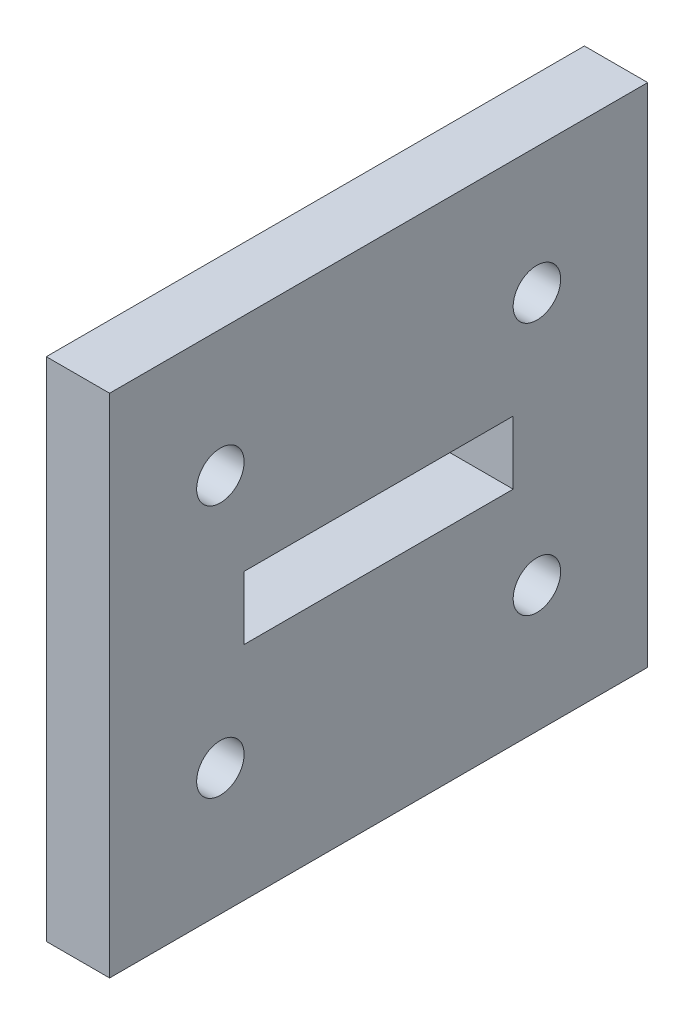
ISO-10303-21;
HEADER;
FILE_DESCRIPTION(('STEP AP214'),'2;1');
FILE_NAME('part.step','',(''),(''),'','','');
FILE_SCHEMA(('AUTOMOTIVE_DESIGN { 1 0 10303 214 1 1 1 1 }'));
ENDSEC;
DATA;
#1=APPLICATION_CONTEXT('core data for automotive mechanical design processes');
#2=APPLICATION_PROTOCOL_DEFINITION('international standard','automotive_design',2000,#1);
#3=PRODUCT_CONTEXT('',#1,'mechanical');
#4=PRODUCT('Part','Part','',(#3));
#5=PRODUCT_RELATED_PRODUCT_CATEGORY('part','',(#4));
#6=PRODUCT_DEFINITION_FORMATION('','',#4);
#7=PRODUCT_DEFINITION_CONTEXT('part definition',#1,'design');
#8=PRODUCT_DEFINITION('design','',#6,#7);
#9=PRODUCT_DEFINITION_SHAPE('','',#8);
#10=(LENGTH_UNIT() NAMED_UNIT(*) SI_UNIT(.MILLI.,.METRE.));
#11=(NAMED_UNIT(*) PLANE_ANGLE_UNIT() SI_UNIT($,.RADIAN.));
#12=(NAMED_UNIT(*) SI_UNIT($,.STERADIAN.) SOLID_ANGLE_UNIT());
#13=UNCERTAINTY_MEASURE_WITH_UNIT(LENGTH_MEASURE(1.E-05),#10,'distance_accuracy_value','');
#14=(GEOMETRIC_REPRESENTATION_CONTEXT(3) GLOBAL_UNCERTAINTY_ASSIGNED_CONTEXT((#13)) GLOBAL_UNIT_ASSIGNED_CONTEXT((#10,
#11,#12)) REPRESENTATION_CONTEXT('',''));
#15=CARTESIAN_POINT('',(0.,0.,0.));
#16=DIRECTION('',(0.,0.,1.));
#17=DIRECTION('',(1.,0.,0.));
#18=AXIS2_PLACEMENT_3D('',#15,#16,#17);
#19=CARTESIAN_POINT('',(29.2,0.,0.));
#20=DIRECTION('',(1.,0.,0.));
#21=DIRECTION('',(0.,1.,0.));
#22=AXIS2_PLACEMENT_3D('',#19,#20,#21);
#23=PLANE('',#22);
#24=DIRECTION('',(0.,-1.,0.));
#25=VECTOR('',#24,1.);
#26=CARTESIAN_POINT('',(29.2,25.4936178572667,4.73630332697817));
#27=LINE('',#26,#25);
#28=CARTESIAN_POINT('',(29.2,25.4936178572667,4.73630332697817));
#29=VERTEX_POINT('',#28);
#30=CARTESIAN_POINT('',(29.2,21.4936178572667,4.73630332697817));
#31=VERTEX_POINT('',#30);
#32=EDGE_CURVE('E50',#29,#31,#27,.T.);
#33=ORIENTED_EDGE('',*,*,#32,.F.);
#34=DIRECTION('',(0.,0.,1.));
#35=VECTOR('',#34,1.);
#36=CARTESIAN_POINT('',(29.2,25.4936178572667,4.73630332697817));
#37=LINE('',#36,#35);
#38=CARTESIAN_POINT('',(29.2,25.4936178572667,-12.2636966730218));
#39=VERTEX_POINT('',#38);
#40=EDGE_CURVE('E118',#39,#29,#37,.T.);
#41=ORIENTED_EDGE('',*,*,#40,.F.);
#42=DIRECTION('',(0.,1.,0.));
#43=VECTOR('',#42,1.);
#44=CARTESIAN_POINT('',(29.2,25.4936178572667,-12.2636966730218));
#45=LINE('',#44,#43);
#46=CARTESIAN_POINT('',(29.2,21.4936178572667,-12.2636966730218));
#47=VERTEX_POINT('',#46);
#48=EDGE_CURVE('E121',#47,#39,#45,.T.);
#49=ORIENTED_EDGE('',*,*,#48,.F.);
#50=DIRECTION('',(0.,0.,-1.));
#51=VECTOR('',#50,1.);
#52=CARTESIAN_POINT('',(29.2,21.4936178572667,4.73630332697817));
#53=LINE('',#52,#51);
#54=EDGE_CURVE('E127',#31,#47,#53,.T.);
#55=ORIENTED_EDGE('',*,*,#54,.F.);
#56=EDGE_LOOP('',(#33,#41,#49,#55));
#57=FACE_BOUND('',#56,.T.);
#58=CARTESIAN_POINT('',(29.2,15.4936178572667,6.23630332697818));
#59=DIRECTION('',(1.,0.,0.));
#60=DIRECTION('',(0.,0.,-1.));
#61=AXIS2_PLACEMENT_3D('',#58,#59,#60);
#62=CIRCLE('',#61,1.5);
#63=CARTESIAN_POINT('',(29.2,15.4936178572667,4.73630332697818));
#64=VERTEX_POINT('',#63);
#65=EDGE_CURVE('E143',#64,#64,#62,.T.);
#66=ORIENTED_EDGE('',*,*,#65,.F.);
#67=EDGE_LOOP('',(#66));
#68=FACE_BOUND('',#67,.T.);
#69=CARTESIAN_POINT('',(29.2,31.4936178572667,6.23630332697817));
#70=DIRECTION('',(1.,0.,0.));
#71=DIRECTION('',(0.,0.,-1.));
#72=AXIS2_PLACEMENT_3D('',#69,#70,#71);
#73=CIRCLE('',#72,1.5);
#74=CARTESIAN_POINT('',(29.2,31.4936178572667,4.73630332697817));
#75=VERTEX_POINT('',#74);
#76=EDGE_CURVE('E155',#75,#75,#73,.T.);
#77=ORIENTED_EDGE('',*,*,#76,.F.);
#78=EDGE_LOOP('',(#77));
#79=FACE_BOUND('',#78,.T.);
#80=DIRECTION('',(0.,-1.,0.));
#81=VECTOR('',#80,1.);
#82=CARTESIAN_POINT('',(29.2,39.4936178572667,13.2363033269782));
#83=LINE('',#82,#81);
#84=CARTESIAN_POINT('',(29.2,39.4936178572667,13.2363033269782));
#85=VERTEX_POINT('',#84);
#86=CARTESIAN_POINT('',(29.2,7.4936178572667,13.2363033269782));
#87=VERTEX_POINT('',#86);
#88=EDGE_CURVE('E161',#85,#87,#83,.T.);
#89=ORIENTED_EDGE('',*,*,#88,.T.);
#90=DIRECTION('',(0.,0.,-1.));
#91=VECTOR('',#90,1.);
#92=CARTESIAN_POINT('',(29.2,7.4936178572667,13.2363033269782));
#93=LINE('',#92,#91);
#94=CARTESIAN_POINT('',(29.2,7.49361785726671,-20.7636966730218));
#95=VERTEX_POINT('',#94);
#96=EDGE_CURVE('E164',#87,#95,#93,.T.);
#97=ORIENTED_EDGE('',*,*,#96,.T.);
#98=DIRECTION('',(0.,1.,0.));
#99=VECTOR('',#98,1.);
#100=CARTESIAN_POINT('',(29.2,7.49361785726671,-20.7636966730218));
#101=LINE('',#100,#99);
#102=CARTESIAN_POINT('',(29.2,39.4936178572667,-20.7636966730218));
#103=VERTEX_POINT('',#102);
#104=EDGE_CURVE('E167',#95,#103,#101,.T.);
#105=ORIENTED_EDGE('',*,*,#104,.T.);
#106=DIRECTION('',(0.,0.,1.));
#107=VECTOR('',#106,1.);
#108=CARTESIAN_POINT('',(29.2,39.4936178572667,-20.7636966730218));
#109=LINE('',#108,#107);
#110=EDGE_CURVE('E169',#103,#85,#109,.T.);
#111=ORIENTED_EDGE('',*,*,#110,.T.);
#112=EDGE_LOOP('',(#89,#97,#105,#111));
#113=FACE_BOUND('',#112,.T.);
#114=CARTESIAN_POINT('',(29.2,31.4936178572667,-13.7636966730218));
#115=DIRECTION('',(1.,0.,0.));
#116=DIRECTION('',(0.,0.,-1.));
#117=AXIS2_PLACEMENT_3D('',#114,#115,#116);
#118=CIRCLE('',#117,1.5);
#119=CARTESIAN_POINT('',(29.2,31.4936178572667,-15.2636966730218));
#120=VERTEX_POINT('',#119);
#121=EDGE_CURVE('E149',#120,#120,#118,.T.);
#122=ORIENTED_EDGE('',*,*,#121,.F.);
#123=EDGE_LOOP('',(#122));
#124=FACE_BOUND('',#123,.T.);
#125=CARTESIAN_POINT('',(29.2,15.4936178572667,-13.7636966730218));
#126=DIRECTION('',(1.,0.,0.));
#127=DIRECTION('',(0.,0.,-1.));
#128=AXIS2_PLACEMENT_3D('',#125,#126,#127);
#129=CIRCLE('',#128,1.5);
#130=CARTESIAN_POINT('',(29.2,15.4936178572667,-15.2636966730218));
#131=VERTEX_POINT('',#130);
#132=EDGE_CURVE('E137',#131,#131,#129,.T.);
#133=ORIENTED_EDGE('',*,*,#132,.F.);
#134=EDGE_LOOP('',(#133));
#135=FACE_BOUND('',#134,.T.);
#136=ADVANCED_FACE('F35',(#57,#68,#79,#113,#124,#135),#23,.T.);
#137=CARTESIAN_POINT('',(25.2,0.,0.));
#138=DIRECTION('',(1.,0.,0.));
#139=DIRECTION('',(0.,1.,0.));
#140=AXIS2_PLACEMENT_3D('',#137,#138,#139);
#141=PLANE('',#140);
#142=DIRECTION('',(0.,0.,1.));
#143=VECTOR('',#142,1.);
#144=CARTESIAN_POINT('',(25.2,25.4936178572667,4.73630332697817));
#145=LINE('',#144,#143);
#146=CARTESIAN_POINT('',(25.2,25.4936178572667,-12.2636966730218));
#147=VERTEX_POINT('',#146);
#148=CARTESIAN_POINT('',(25.2,25.4936178572667,4.73630332697817));
#149=VERTEX_POINT('',#148);
#150=EDGE_CURVE('E108',#147,#149,#145,.T.);
#151=ORIENTED_EDGE('',*,*,#150,.T.);
#152=DIRECTION('',(0.,-1.,0.));
#153=VECTOR('',#152,1.);
#154=CARTESIAN_POINT('',(25.2,25.4936178572667,4.73630332697817));
#155=LINE('',#154,#153);
#156=CARTESIAN_POINT('',(25.2,21.4936178572667,4.73630332697817));
#157=VERTEX_POINT('',#156);
#158=EDGE_CURVE('E102',#149,#157,#155,.T.);
#159=ORIENTED_EDGE('',*,*,#158,.T.);
#160=DIRECTION('',(0.,0.,-1.));
#161=VECTOR('',#160,1.);
#162=CARTESIAN_POINT('',(25.2,21.4936178572667,4.73630332697817));
#163=LINE('',#162,#161);
#164=CARTESIAN_POINT('',(25.2,21.4936178572667,-12.2636966730218));
#165=VERTEX_POINT('',#164);
#166=EDGE_CURVE('E111',#157,#165,#163,.T.);
#167=ORIENTED_EDGE('',*,*,#166,.T.);
#168=DIRECTION('',(0.,1.,0.));
#169=VECTOR('',#168,1.);
#170=CARTESIAN_POINT('',(25.2,25.4936178572667,-12.2636966730218));
#171=LINE('',#170,#169);
#172=EDGE_CURVE('E58',#165,#147,#171,.T.);
#173=ORIENTED_EDGE('',*,*,#172,.T.);
#174=EDGE_LOOP('',(#151,#159,#167,#173));
#175=FACE_BOUND('',#174,.T.);
#176=DIRECTION('',(0.,-1.,0.));
#177=VECTOR('',#176,1.);
#178=CARTESIAN_POINT('',(25.2,39.4936178572667,13.2363033269782));
#179=LINE('',#178,#177);
#180=CARTESIAN_POINT('',(25.2,39.4936178572667,13.2363033269782));
#181=VERTEX_POINT('',#180);
#182=CARTESIAN_POINT('',(25.2,7.4936178572667,13.2363033269782));
#183=VERTEX_POINT('',#182);
#184=EDGE_CURVE('E158',#181,#183,#179,.T.);
#185=ORIENTED_EDGE('',*,*,#184,.F.);
#186=DIRECTION('',(0.,0.,1.));
#187=VECTOR('',#186,1.);
#188=CARTESIAN_POINT('',(25.2,39.4936178572667,-20.7636966730218));
#189=LINE('',#188,#187);
#190=CARTESIAN_POINT('',(25.2,39.4936178572667,-20.7636966730218));
#191=VERTEX_POINT('',#190);
#192=EDGE_CURVE('E165',#191,#181,#189,.T.);
#193=ORIENTED_EDGE('',*,*,#192,.F.);
#194=DIRECTION('',(0.,1.,0.));
#195=VECTOR('',#194,1.);
#196=CARTESIAN_POINT('',(25.2,7.49361785726671,-20.7636966730218));
#197=LINE('',#196,#195);
#198=CARTESIAN_POINT('',(25.2,7.49361785726671,-20.7636966730218));
#199=VERTEX_POINT('',#198);
#200=EDGE_CURVE('E176',#199,#191,#197,.T.);
#201=ORIENTED_EDGE('',*,*,#200,.F.);
#202=DIRECTION('',(0.,0.,-1.));
#203=VECTOR('',#202,1.);
#204=CARTESIAN_POINT('',(25.2,7.4936178572667,13.2363033269782));
#205=LINE('',#204,#203);
#206=EDGE_CURVE('E174',#183,#199,#205,.T.);
#207=ORIENTED_EDGE('',*,*,#206,.F.);
#208=EDGE_LOOP('',(#185,#193,#201,#207));
#209=FACE_BOUND('',#208,.T.);
#210=CARTESIAN_POINT('',(25.2,31.4936178572667,6.23630332697817));
#211=DIRECTION('',(1.,0.,0.));
#212=DIRECTION('',(0.,0.,-1.));
#213=AXIS2_PLACEMENT_3D('',#210,#211,#212);
#214=CIRCLE('',#213,1.5);
#215=CARTESIAN_POINT('',(25.2,31.4936178572667,4.73630332697817));
#216=VERTEX_POINT('',#215);
#217=EDGE_CURVE('E152',#216,#216,#214,.T.);
#218=ORIENTED_EDGE('',*,*,#217,.T.);
#219=EDGE_LOOP('',(#218));
#220=FACE_BOUND('',#219,.T.);
#221=CARTESIAN_POINT('',(25.2,31.4936178572667,-13.7636966730218));
#222=DIRECTION('',(1.,0.,0.));
#223=DIRECTION('',(0.,0.,-1.));
#224=AXIS2_PLACEMENT_3D('',#221,#222,#223);
#225=CIRCLE('',#224,1.5);
#226=CARTESIAN_POINT('',(25.2,31.4936178572667,-15.2636966730218));
#227=VERTEX_POINT('',#226);
#228=EDGE_CURVE('E146',#227,#227,#225,.T.);
#229=ORIENTED_EDGE('',*,*,#228,.T.);
#230=EDGE_LOOP('',(#229));
#231=FACE_BOUND('',#230,.T.);
#232=CARTESIAN_POINT('',(25.2,15.4936178572667,6.23630332697818));
#233=DIRECTION('',(1.,0.,0.));
#234=DIRECTION('',(0.,0.,-1.));
#235=AXIS2_PLACEMENT_3D('',#232,#233,#234);
#236=CIRCLE('',#235,1.5);
#237=CARTESIAN_POINT('',(25.2,15.4936178572667,4.73630332697818));
#238=VERTEX_POINT('',#237);
#239=EDGE_CURVE('E140',#238,#238,#236,.T.);
#240=ORIENTED_EDGE('',*,*,#239,.T.);
#241=EDGE_LOOP('',(#240));
#242=FACE_BOUND('',#241,.T.);
#243=CARTESIAN_POINT('',(25.2,15.4936178572667,-13.7636966730218));
#244=DIRECTION('',(1.,0.,0.));
#245=DIRECTION('',(0.,0.,-1.));
#246=AXIS2_PLACEMENT_3D('',#243,#244,#245);
#247=CIRCLE('',#246,1.5);
#248=CARTESIAN_POINT('',(25.2,15.4936178572667,-15.2636966730218));
#249=VERTEX_POINT('',#248);
#250=EDGE_CURVE('E133',#249,#249,#247,.T.);
#251=ORIENTED_EDGE('',*,*,#250,.T.);
#252=EDGE_LOOP('',(#251));
#253=FACE_BOUND('',#252,.T.);
#254=ADVANCED_FACE('F115',(#175,#209,#220,#231,#242,#253),#141,.F.);
#255=CARTESIAN_POINT('',(29.2,39.4936178572667,13.2363033269782));
#256=DIRECTION('',(0.,0.,-1.));
#257=DIRECTION('',(-1.,0.,0.));
#258=AXIS2_PLACEMENT_3D('',#255,#256,#257);
#259=PLANE('',#258);
#260=ORIENTED_EDGE('',*,*,#184,.T.);
#261=DIRECTION('',(-1.,0.,0.));
#262=VECTOR('',#261,1.);
#263=CARTESIAN_POINT('',(29.2,7.4936178572667,13.2363033269782));
#264=LINE('',#263,#262);
#265=EDGE_CURVE('E11',#87,#183,#264,.T.);
#266=ORIENTED_EDGE('',*,*,#265,.F.);
#267=ORIENTED_EDGE('',*,*,#88,.F.);
#268=DIRECTION('',(-1.,0.,0.));
#269=VECTOR('',#268,1.);
#270=CARTESIAN_POINT('',(29.2,39.4936178572667,13.2363033269782));
#271=LINE('',#270,#269);
#272=EDGE_CURVE('E171',#85,#181,#271,.T.);
#273=ORIENTED_EDGE('',*,*,#272,.T.);
#274=EDGE_LOOP('',(#260,#266,#267,#273));
#275=FACE_BOUND('',#274,.T.);
#276=ADVANCED_FACE('F37',(#275),#259,.F.);
#277=CARTESIAN_POINT('',(29.2,7.4936178572667,13.2363033269782));
#278=DIRECTION('',(0.,1.,0.));
#279=DIRECTION('',(-1.,0.,0.));
#280=AXIS2_PLACEMENT_3D('',#277,#278,#279);
#281=PLANE('',#280);
#282=ORIENTED_EDGE('',*,*,#206,.T.);
#283=DIRECTION('',(-1.,0.,0.));
#284=VECTOR('',#283,1.);
#285=CARTESIAN_POINT('',(29.2,7.49361785726671,-20.7636966730218));
#286=LINE('',#285,#284);
#287=EDGE_CURVE('E43',#95,#199,#286,.T.);
#288=ORIENTED_EDGE('',*,*,#287,.F.);
#289=ORIENTED_EDGE('',*,*,#96,.F.);
#290=ORIENTED_EDGE('',*,*,#265,.T.);
#291=EDGE_LOOP('',(#282,#288,#289,#290));
#292=FACE_BOUND('',#291,.T.);
#293=ADVANCED_FACE('F203',(#292),#281,.F.);
#294=CARTESIAN_POINT('',(29.2,7.49361785726671,-20.7636966730218));
#295=DIRECTION('',(0.,0.,1.));
#296=DIRECTION('',(1.,0.,0.));
#297=AXIS2_PLACEMENT_3D('',#294,#295,#296);
#298=PLANE('',#297);
#299=ORIENTED_EDGE('',*,*,#200,.T.);
#300=DIRECTION('',(-1.,0.,0.));
#301=VECTOR('',#300,1.);
#302=CARTESIAN_POINT('',(29.2,39.4936178572667,-20.7636966730218));
#303=LINE('',#302,#301);
#304=EDGE_CURVE('E181',#103,#191,#303,.T.);
#305=ORIENTED_EDGE('',*,*,#304,.F.);
#306=ORIENTED_EDGE('',*,*,#104,.F.);
#307=ORIENTED_EDGE('',*,*,#287,.T.);
#308=EDGE_LOOP('',(#299,#305,#306,#307));
#309=FACE_BOUND('',#308,.T.);
#310=ADVANCED_FACE('F188',(#309),#298,.F.);
#311=CARTESIAN_POINT('',(29.2,39.4936178572667,-20.7636966730218));
#312=DIRECTION('',(0.,-1.,0.));
#313=DIRECTION('',(1.,0.,0.));
#314=AXIS2_PLACEMENT_3D('',#311,#312,#313);
#315=PLANE('',#314);
#316=ORIENTED_EDGE('',*,*,#192,.T.);
#317=ORIENTED_EDGE('',*,*,#272,.F.);
#318=ORIENTED_EDGE('',*,*,#110,.F.);
#319=ORIENTED_EDGE('',*,*,#304,.T.);
#320=EDGE_LOOP('',(#316,#317,#318,#319));
#321=FACE_BOUND('',#320,.T.);
#322=ADVANCED_FACE('F196',(#321),#315,.F.);
#323=CARTESIAN_POINT('',(29.2,31.4936178572667,6.23630332697817));
#324=DIRECTION('',(-1.,0.,0.));
#325=DIRECTION('',(0.,0.,1.));
#326=AXIS2_PLACEMENT_3D('',#323,#324,#325);
#327=CYLINDRICAL_SURFACE('',#326,1.5);
#328=ORIENTED_EDGE('',*,*,#76,.T.);
#329=EDGE_LOOP('',(#328));
#330=FACE_BOUND('',#329,.T.);
#331=ORIENTED_EDGE('',*,*,#217,.F.);
#332=EDGE_LOOP('',(#331));
#333=FACE_BOUND('',#332,.T.);
#334=ADVANCED_FACE('F219',(#330,#333),#327,.F.);
#335=CARTESIAN_POINT('',(29.2,31.4936178572667,-13.7636966730218));
#336=DIRECTION('',(-1.,0.,0.));
#337=DIRECTION('',(0.,0.,1.));
#338=AXIS2_PLACEMENT_3D('',#335,#336,#337);
#339=CYLINDRICAL_SURFACE('',#338,1.5);
#340=ORIENTED_EDGE('',*,*,#121,.T.);
#341=EDGE_LOOP('',(#340));
#342=FACE_BOUND('',#341,.T.);
#343=ORIENTED_EDGE('',*,*,#228,.F.);
#344=EDGE_LOOP('',(#343));
#345=FACE_BOUND('',#344,.T.);
#346=ADVANCED_FACE('F226',(#342,#345),#339,.F.);
#347=CARTESIAN_POINT('',(29.2,15.4936178572667,6.23630332697818));
#348=DIRECTION('',(-1.,0.,0.));
#349=DIRECTION('',(0.,0.,1.));
#350=AXIS2_PLACEMENT_3D('',#347,#348,#349);
#351=CYLINDRICAL_SURFACE('',#350,1.5);
#352=ORIENTED_EDGE('',*,*,#65,.T.);
#353=EDGE_LOOP('',(#352));
#354=FACE_BOUND('',#353,.T.);
#355=ORIENTED_EDGE('',*,*,#239,.F.);
#356=EDGE_LOOP('',(#355));
#357=FACE_BOUND('',#356,.T.);
#358=ADVANCED_FACE('F231',(#354,#357),#351,.F.);
#359=CARTESIAN_POINT('',(29.2,15.4936178572667,-13.7636966730218));
#360=DIRECTION('',(-1.,0.,0.));
#361=DIRECTION('',(0.,0.,1.));
#362=AXIS2_PLACEMENT_3D('',#359,#360,#361);
#363=CYLINDRICAL_SURFACE('',#362,1.5);
#364=ORIENTED_EDGE('',*,*,#132,.T.);
#365=EDGE_LOOP('',(#364));
#366=FACE_BOUND('',#365,.T.);
#367=ORIENTED_EDGE('',*,*,#250,.F.);
#368=EDGE_LOOP('',(#367));
#369=FACE_BOUND('',#368,.T.);
#370=ADVANCED_FACE('F243',(#366,#369),#363,.F.);
#371=CARTESIAN_POINT('',(25.2,25.4936178572667,4.73630332697817));
#372=DIRECTION('',(0.,0.,1.));
#373=DIRECTION('',(0.,-1.,0.));
#374=AXIS2_PLACEMENT_3D('',#371,#372,#373);
#375=PLANE('',#374);
#376=ORIENTED_EDGE('',*,*,#32,.T.);
#377=DIRECTION('',(1.,0.,0.));
#378=VECTOR('',#377,1.);
#379=CARTESIAN_POINT('',(25.2,21.4936178572667,4.73630332697817));
#380=LINE('',#379,#378);
#381=EDGE_CURVE('E98',#157,#31,#380,.T.);
#382=ORIENTED_EDGE('',*,*,#381,.F.);
#383=ORIENTED_EDGE('',*,*,#158,.F.);
#384=DIRECTION('',(1.,0.,0.));
#385=VECTOR('',#384,1.);
#386=CARTESIAN_POINT('',(25.2,25.4936178572667,4.73630332697817));
#387=LINE('',#386,#385);
#388=EDGE_CURVE('E131',#149,#29,#387,.T.);
#389=ORIENTED_EDGE('',*,*,#388,.T.);
#390=EDGE_LOOP('',(#376,#382,#383,#389));
#391=FACE_BOUND('',#390,.T.);
#392=ADVANCED_FACE('F100',(#391),#375,.F.);
#393=CARTESIAN_POINT('',(25.2,25.4936178572667,4.73630332697817));
#394=DIRECTION('',(0.,1.,0.));
#395=DIRECTION('',(0.,0.,1.));
#396=AXIS2_PLACEMENT_3D('',#393,#394,#395);
#397=PLANE('',#396);
#398=ORIENTED_EDGE('',*,*,#40,.T.);
#399=ORIENTED_EDGE('',*,*,#388,.F.);
#400=ORIENTED_EDGE('',*,*,#150,.F.);
#401=DIRECTION('',(1.,0.,0.));
#402=VECTOR('',#401,1.);
#403=CARTESIAN_POINT('',(25.2,25.4936178572667,-12.2636966730218));
#404=LINE('',#403,#402);
#405=EDGE_CURVE('E134',#147,#39,#404,.T.);
#406=ORIENTED_EDGE('',*,*,#405,.T.);
#407=EDGE_LOOP('',(#398,#399,#400,#406));
#408=FACE_BOUND('',#407,.T.);
#409=ADVANCED_FACE('F251',(#408),#397,.F.);
#410=CARTESIAN_POINT('',(25.2,25.4936178572667,-12.2636966730218));
#411=DIRECTION('',(0.,0.,-1.));
#412=DIRECTION('',(-1.,0.,0.));
#413=AXIS2_PLACEMENT_3D('',#410,#411,#412);
#414=PLANE('',#413);
#415=ORIENTED_EDGE('',*,*,#48,.T.);
#416=ORIENTED_EDGE('',*,*,#405,.F.);
#417=ORIENTED_EDGE('',*,*,#172,.F.);
#418=DIRECTION('',(1.,0.,0.));
#419=VECTOR('',#418,1.);
#420=CARTESIAN_POINT('',(25.2,21.4936178572667,-12.2636966730218));
#421=LINE('',#420,#419);
#422=EDGE_CURVE('E107',#165,#47,#421,.T.);
#423=ORIENTED_EDGE('',*,*,#422,.T.);
#424=EDGE_LOOP('',(#415,#416,#417,#423));
#425=FACE_BOUND('',#424,.T.);
#426=ADVANCED_FACE('F258',(#425),#414,.F.);
#427=CARTESIAN_POINT('',(25.2,21.4936178572667,4.73630332697817));
#428=DIRECTION('',(0.,-1.,0.));
#429=DIRECTION('',(0.,0.,-1.));
#430=AXIS2_PLACEMENT_3D('',#427,#428,#429);
#431=PLANE('',#430);
#432=ORIENTED_EDGE('',*,*,#54,.T.);
#433=ORIENTED_EDGE('',*,*,#422,.F.);
#434=ORIENTED_EDGE('',*,*,#166,.F.);
#435=ORIENTED_EDGE('',*,*,#381,.T.);
#436=EDGE_LOOP('',(#432,#433,#434,#435));
#437=FACE_BOUND('',#436,.T.);
#438=ADVANCED_FACE('F112',(#437),#431,.F.);
#439=CLOSED_SHELL('',(#136,#254,#276,#293,#310,#322,#334,#346,#358,#370,#392,#409,#426,#438));
#440=MANIFOLD_SOLID_BREP('B2',#439);
#441=ADVANCED_BREP_SHAPE_REPRESENTATION('',(#18,#440),#14);
#442=SHAPE_DEFINITION_REPRESENTATION(#9,#441);
ENDSEC;
END-ISO-10303-21;
